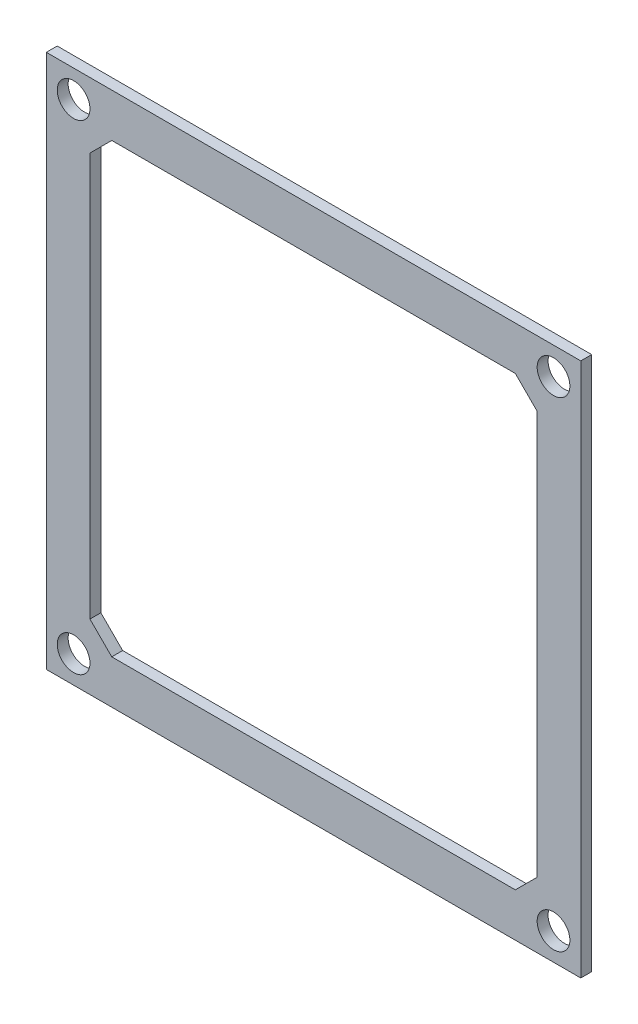
ISO-10303-21;
HEADER;
FILE_DESCRIPTION(('STEP AP214'),'2;1');
FILE_NAME('part.step','',(''),(''),'','','');
FILE_SCHEMA(('AUTOMOTIVE_DESIGN { 1 0 10303 214 1 1 1 1 }'));
ENDSEC;
DATA;
#1=APPLICATION_CONTEXT('core data for automotive mechanical design processes');
#2=APPLICATION_PROTOCOL_DEFINITION('international standard','automotive_design',2000,#1);
#3=PRODUCT_CONTEXT('',#1,'mechanical');
#4=PRODUCT('Part','Part','',(#3));
#5=PRODUCT_RELATED_PRODUCT_CATEGORY('part','',(#4));
#6=PRODUCT_DEFINITION_FORMATION('','',#4);
#7=PRODUCT_DEFINITION_CONTEXT('part definition',#1,'design');
#8=PRODUCT_DEFINITION('design','',#6,#7);
#9=PRODUCT_DEFINITION_SHAPE('','',#8);
#10=(LENGTH_UNIT() NAMED_UNIT(*) SI_UNIT(.MILLI.,.METRE.));
#11=(NAMED_UNIT(*) PLANE_ANGLE_UNIT() SI_UNIT($,.RADIAN.));
#12=(NAMED_UNIT(*) SI_UNIT($,.STERADIAN.) SOLID_ANGLE_UNIT());
#13=UNCERTAINTY_MEASURE_WITH_UNIT(LENGTH_MEASURE(1.E-05),#10,'distance_accuracy_value','');
#14=(GEOMETRIC_REPRESENTATION_CONTEXT(3) GLOBAL_UNCERTAINTY_ASSIGNED_CONTEXT((#13)) GLOBAL_UNIT_ASSIGNED_CONTEXT((#10,
#11,#12)) REPRESENTATION_CONTEXT('',''));
#15=CARTESIAN_POINT('',(0.,0.,0.));
#16=DIRECTION('',(0.,0.,1.));
#17=DIRECTION('',(1.,0.,0.));
#18=AXIS2_PLACEMENT_3D('',#15,#16,#17);
#19=CARTESIAN_POINT('',(0.,0.,1.));
#20=DIRECTION('',(0.,0.,1.));
#21=DIRECTION('',(1.,0.,0.));
#22=AXIS2_PLACEMENT_3D('',#19,#20,#21);
#23=PLANE('',#22);
#24=CARTESIAN_POINT('',(-18.5765575330891,-16.8021283227848,1.));
#25=DIRECTION('',(0.,0.,1.));
#26=DIRECTION('',(1.,0.,0.));
#27=AXIS2_PLACEMENT_3D('',#24,#25,#26);
#28=CIRCLE('',#27,1.5);
#29=CARTESIAN_POINT('',(-17.0765575330891,-16.8021283227848,1.));
#30=VERTEX_POINT('',#29);
#31=EDGE_CURVE('E313',#30,#30,#28,.T.);
#32=ORIENTED_EDGE('',*,*,#31,.F.);
#33=EDGE_LOOP('',(#32));
#34=FACE_BOUND('',#33,.T.);
#35=CARTESIAN_POINT('',(-62.5765575330896,27.1978716772152,1.));
#36=DIRECTION('',(0.,0.,1.));
#37=DIRECTION('',(1.,0.,0.));
#38=AXIS2_PLACEMENT_3D('',#35,#36,#37);
#39=CIRCLE('',#38,1.5);
#40=CARTESIAN_POINT('',(-61.0765575330896,27.1978716772152,1.));
#41=VERTEX_POINT('',#40);
#42=EDGE_CURVE('E159',#41,#41,#39,.T.);
#43=ORIENTED_EDGE('',*,*,#42,.F.);
#44=EDGE_LOOP('',(#43));
#45=FACE_BOUND('',#44,.T.);
#46=DIRECTION('',(0.,-1.,0.));
#47=VECTOR('',#46,1.);
#48=CARTESIAN_POINT('',(-65.0765575330896,29.6978716772152,1.));
#49=LINE('',#48,#47);
#50=CARTESIAN_POINT('',(-65.0765575330896,29.6978716772152,1.));
#51=VERTEX_POINT('',#50);
#52=CARTESIAN_POINT('',(-65.0765575330896,-19.3021283227848,1.));
#53=VERTEX_POINT('',#52);
#54=EDGE_CURVE('E189',#51,#53,#49,.T.);
#55=ORIENTED_EDGE('',*,*,#54,.T.);
#56=DIRECTION('',(1.,0.,0.));
#57=VECTOR('',#56,1.);
#58=CARTESIAN_POINT('',(-65.0765575330896,-19.3021283227848,1.));
#59=LINE('',#58,#57);
#60=CARTESIAN_POINT('',(-16.0765575330896,-19.3021283227848,1.));
#61=VERTEX_POINT('',#60);
#62=EDGE_CURVE('E192',#53,#61,#59,.T.);
#63=ORIENTED_EDGE('',*,*,#62,.T.);
#64=DIRECTION('',(0.,1.,0.));
#65=VECTOR('',#64,1.);
#66=CARTESIAN_POINT('',(-16.0765575330896,29.6978716772152,1.));
#67=LINE('',#66,#65);
#68=CARTESIAN_POINT('',(-16.0765575330896,29.6978716772152,1.));
#69=VERTEX_POINT('',#68);
#70=EDGE_CURVE('E195',#61,#69,#67,.T.);
#71=ORIENTED_EDGE('',*,*,#70,.T.);
#72=DIRECTION('',(-1.,0.,0.));
#73=VECTOR('',#72,1.);
#74=CARTESIAN_POINT('',(-65.0765575330896,29.6978716772152,1.));
#75=LINE('',#74,#73);
#76=EDGE_CURVE('E197',#69,#51,#75,.T.);
#77=ORIENTED_EDGE('',*,*,#76,.T.);
#78=EDGE_LOOP('',(#55,#63,#71,#77));
#79=FACE_BOUND('',#78,.T.);
#80=DIRECTION('',(0.,-1.,0.));
#81=VECTOR('',#80,1.);
#82=CARTESIAN_POINT('',(-61.0765575330896,23.6978716772152,1.));
#83=LINE('',#82,#81);
#84=CARTESIAN_POINT('',(-61.0765575330896,23.6978716772152,1.));
#85=VERTEX_POINT('',#84);
#86=CARTESIAN_POINT('',(-61.0765575330896,-13.3021283227848,1.));
#87=VERTEX_POINT('',#86);
#88=EDGE_CURVE('E129',#85,#87,#83,.T.);
#89=ORIENTED_EDGE('',*,*,#88,.F.);
#90=DIRECTION('',(-0.707106781186552,-0.707106781186543,0.));
#91=VECTOR('',#90,1.);
#92=CARTESIAN_POINT('',(-59.0765575330896,25.6978716772152,1.));
#93=LINE('',#92,#91);
#94=CARTESIAN_POINT('',(-59.0765575330896,25.6978716772152,1.));
#95=VERTEX_POINT('',#94);
#96=EDGE_CURVE('E121',#95,#85,#93,.T.);
#97=ORIENTED_EDGE('',*,*,#96,.F.);
#98=DIRECTION('',(-1.,0.,0.));
#99=VECTOR('',#98,1.);
#100=CARTESIAN_POINT('',(-22.0765575330896,25.6978716772152,1.));
#101=LINE('',#100,#99);
#102=CARTESIAN_POINT('',(-22.0765575330896,25.6978716772152,1.));
#103=VERTEX_POINT('',#102);
#104=EDGE_CURVE('E156',#103,#95,#101,.T.);
#105=ORIENTED_EDGE('',*,*,#104,.F.);
#106=DIRECTION('',(-0.707106781186559,0.707106781186536,0.));
#107=VECTOR('',#106,1.);
#108=CARTESIAN_POINT('',(-20.0765575330895,23.6978716772152,1.));
#109=LINE('',#108,#107);
#110=CARTESIAN_POINT('',(-20.0765575330895,23.6978716772152,1.));
#111=VERTEX_POINT('',#110);
#112=EDGE_CURVE('E154',#111,#103,#109,.T.);
#113=ORIENTED_EDGE('',*,*,#112,.F.);
#114=DIRECTION('',(0.,1.,0.));
#115=VECTOR('',#114,1.);
#116=CARTESIAN_POINT('',(-20.0765575330896,-13.3021283227848,1.));
#117=LINE('',#116,#115);
#118=CARTESIAN_POINT('',(-20.0765575330896,-13.3021283227848,1.));
#119=VERTEX_POINT('',#118);
#120=EDGE_CURVE('E152',#119,#111,#117,.T.);
#121=ORIENTED_EDGE('',*,*,#120,.F.);
#122=DIRECTION('',(0.707106781186536,0.707106781186559,0.));
#123=VECTOR('',#122,1.);
#124=CARTESIAN_POINT('',(-22.0765575330895,-15.3021283227848,1.));
#125=LINE('',#124,#123);
#126=CARTESIAN_POINT('',(-22.0765575330895,-15.3021283227848,1.));
#127=VERTEX_POINT('',#126);
#128=EDGE_CURVE('E150',#127,#119,#125,.T.);
#129=ORIENTED_EDGE('',*,*,#128,.F.);
#130=DIRECTION('',(1.,0.,0.));
#131=VECTOR('',#130,1.);
#132=CARTESIAN_POINT('',(-59.0765575330895,-15.3021283227848,1.));
#133=LINE('',#132,#131);
#134=CARTESIAN_POINT('',(-59.0765575330895,-15.3021283227848,1.));
#135=VERTEX_POINT('',#134);
#136=EDGE_CURVE('E145',#135,#127,#133,.T.);
#137=ORIENTED_EDGE('',*,*,#136,.F.);
#138=DIRECTION('',(0.707106781186559,-0.707106781186536,0.));
#139=VECTOR('',#138,1.);
#140=CARTESIAN_POINT('',(-61.0765575330896,-13.3021283227848,1.));
#141=LINE('',#140,#139);
#142=EDGE_CURVE('E143',#87,#135,#141,.T.);
#143=ORIENTED_EDGE('',*,*,#142,.F.);
#144=EDGE_LOOP('',(#89,#97,#105,#113,#121,#129,#137,#143));
#145=FACE_BOUND('',#144,.T.);
#146=CARTESIAN_POINT('',(-18.5765575330896,27.1978716772152,1.));
#147=DIRECTION('',(0.,0.,1.));
#148=DIRECTION('',(1.,0.,0.));
#149=AXIS2_PLACEMENT_3D('',#146,#147,#148);
#150=CIRCLE('',#149,1.5);
#151=CARTESIAN_POINT('',(-17.0765575330896,27.1978716772152,1.));
#152=VERTEX_POINT('',#151);
#153=EDGE_CURVE('E319',#152,#152,#150,.T.);
#154=ORIENTED_EDGE('',*,*,#153,.F.);
#155=EDGE_LOOP('',(#154));
#156=FACE_BOUND('',#155,.T.);
#157=CARTESIAN_POINT('',(-62.5765575330891,-16.8021283227848,1.));
#158=DIRECTION('',(0.,0.,1.));
#159=DIRECTION('',(1.,0.,0.));
#160=AXIS2_PLACEMENT_3D('',#157,#158,#159);
#161=CIRCLE('',#160,1.5);
#162=CARTESIAN_POINT('',(-61.0765575330891,-16.8021283227848,1.));
#163=VERTEX_POINT('',#162);
#164=EDGE_CURVE('E304',#163,#163,#161,.T.);
#165=ORIENTED_EDGE('',*,*,#164,.F.);
#166=EDGE_LOOP('',(#165));
#167=FACE_BOUND('',#166,.T.);
#168=ADVANCED_FACE('F32',(#34,#45,#79,#145,#156,#167),#23,.T.);
#169=CARTESIAN_POINT('',(0.,0.,0.));
#170=DIRECTION('',(0.,0.,1.));
#171=DIRECTION('',(1.,0.,0.));
#172=AXIS2_PLACEMENT_3D('',#169,#170,#171);
#173=PLANE('',#172);
#174=DIRECTION('',(0.,-1.,0.));
#175=VECTOR('',#174,1.);
#176=CARTESIAN_POINT('',(-65.0765575330896,29.6978716772152,0.));
#177=LINE('',#176,#175);
#178=CARTESIAN_POINT('',(-65.0765575330896,29.6978716772152,0.));
#179=VERTEX_POINT('',#178);
#180=CARTESIAN_POINT('',(-65.0765575330896,-19.3021283227848,0.));
#181=VERTEX_POINT('',#180);
#182=EDGE_CURVE('E137',#179,#181,#177,.T.);
#183=ORIENTED_EDGE('',*,*,#182,.F.);
#184=DIRECTION('',(-1.,0.,0.));
#185=VECTOR('',#184,1.);
#186=CARTESIAN_POINT('',(-65.0765575330896,29.6978716772152,0.));
#187=LINE('',#186,#185);
#188=CARTESIAN_POINT('',(-16.0765575330896,29.6978716772152,0.));
#189=VERTEX_POINT('',#188);
#190=EDGE_CURVE('E193',#189,#179,#187,.T.);
#191=ORIENTED_EDGE('',*,*,#190,.F.);
#192=DIRECTION('',(0.,1.,0.));
#193=VECTOR('',#192,1.);
#194=CARTESIAN_POINT('',(-16.0765575330896,29.6978716772152,0.));
#195=LINE('',#194,#193);
#196=CARTESIAN_POINT('',(-16.0765575330896,-19.3021283227848,0.));
#197=VERTEX_POINT('',#196);
#198=EDGE_CURVE('E204',#197,#189,#195,.T.);
#199=ORIENTED_EDGE('',*,*,#198,.F.);
#200=DIRECTION('',(1.,0.,0.));
#201=VECTOR('',#200,1.);
#202=CARTESIAN_POINT('',(-65.0765575330896,-19.3021283227848,0.));
#203=LINE('',#202,#201);
#204=EDGE_CURVE('E202',#181,#197,#203,.T.);
#205=ORIENTED_EDGE('',*,*,#204,.F.);
#206=EDGE_LOOP('',(#183,#191,#199,#205));
#207=FACE_BOUND('',#206,.T.);
#208=DIRECTION('',(-0.707106781186552,-0.707106781186543,0.));
#209=VECTOR('',#208,1.);
#210=CARTESIAN_POINT('',(-59.0765575330896,25.6978716772152,0.));
#211=LINE('',#210,#209);
#212=CARTESIAN_POINT('',(-59.0765575330896,25.6978716772152,0.));
#213=VERTEX_POINT('',#212);
#214=CARTESIAN_POINT('',(-61.0765575330896,23.6978716772152,0.));
#215=VERTEX_POINT('',#214);
#216=EDGE_CURVE('E55',#213,#215,#211,.T.);
#217=ORIENTED_EDGE('',*,*,#216,.T.);
#218=DIRECTION('',(0.,-1.,0.));
#219=VECTOR('',#218,1.);
#220=CARTESIAN_POINT('',(-61.0765575330896,23.6978716772152,0.));
#221=LINE('',#220,#219);
#222=CARTESIAN_POINT('',(-61.0765575330896,-13.3021283227848,0.));
#223=VERTEX_POINT('',#222);
#224=EDGE_CURVE('E136',#215,#223,#221,.T.);
#225=ORIENTED_EDGE('',*,*,#224,.T.);
#226=DIRECTION('',(0.707106781186559,-0.707106781186536,0.));
#227=VECTOR('',#226,1.);
#228=CARTESIAN_POINT('',(-61.0765575330896,-13.3021283227848,0.));
#229=LINE('',#228,#227);
#230=CARTESIAN_POINT('',(-59.0765575330895,-15.3021283227848,0.));
#231=VERTEX_POINT('',#230);
#232=EDGE_CURVE('E161',#223,#231,#229,.T.);
#233=ORIENTED_EDGE('',*,*,#232,.T.);
#234=DIRECTION('',(1.,0.,0.));
#235=VECTOR('',#234,1.);
#236=CARTESIAN_POINT('',(-59.0765575330895,-15.3021283227848,0.));
#237=LINE('',#236,#235);
#238=CARTESIAN_POINT('',(-22.0765575330895,-15.3021283227848,0.));
#239=VERTEX_POINT('',#238);
#240=EDGE_CURVE('E164',#231,#239,#237,.T.);
#241=ORIENTED_EDGE('',*,*,#240,.T.);
#242=DIRECTION('',(0.707106781186536,0.707106781186559,0.));
#243=VECTOR('',#242,1.);
#244=CARTESIAN_POINT('',(-22.0765575330895,-15.3021283227848,0.));
#245=LINE('',#244,#243);
#246=CARTESIAN_POINT('',(-20.0765575330896,-13.3021283227848,0.));
#247=VERTEX_POINT('',#246);
#248=EDGE_CURVE('E167',#239,#247,#245,.T.);
#249=ORIENTED_EDGE('',*,*,#248,.T.);
#250=DIRECTION('',(0.,1.,0.));
#251=VECTOR('',#250,1.);
#252=CARTESIAN_POINT('',(-20.0765575330896,-13.3021283227848,0.));
#253=LINE('',#252,#251);
#254=CARTESIAN_POINT('',(-20.0765575330895,23.6978716772152,0.));
#255=VERTEX_POINT('',#254);
#256=EDGE_CURVE('E170',#247,#255,#253,.T.);
#257=ORIENTED_EDGE('',*,*,#256,.T.);
#258=DIRECTION('',(-0.707106781186559,0.707106781186536,0.));
#259=VECTOR('',#258,1.);
#260=CARTESIAN_POINT('',(-20.0765575330895,23.6978716772152,0.));
#261=LINE('',#260,#259);
#262=CARTESIAN_POINT('',(-22.0765575330896,25.6978716772152,0.));
#263=VERTEX_POINT('',#262);
#264=EDGE_CURVE('E173',#255,#263,#261,.T.);
#265=ORIENTED_EDGE('',*,*,#264,.T.);
#266=DIRECTION('',(-1.,0.,0.));
#267=VECTOR('',#266,1.);
#268=CARTESIAN_POINT('',(-22.0765575330896,25.6978716772152,0.));
#269=LINE('',#268,#267);
#270=EDGE_CURVE('E130',#263,#213,#269,.T.);
#271=ORIENTED_EDGE('',*,*,#270,.T.);
#272=EDGE_LOOP('',(#217,#225,#233,#241,#249,#257,#265,#271));
#273=FACE_BOUND('',#272,.T.);
#274=CARTESIAN_POINT('',(-62.5765575330896,27.1978716772152,0.));
#275=DIRECTION('',(0.,0.,1.));
#276=DIRECTION('',(1.,0.,0.));
#277=AXIS2_PLACEMENT_3D('',#274,#275,#276);
#278=CIRCLE('',#277,1.5);
#279=CARTESIAN_POINT('',(-61.0765575330896,27.1978716772152,0.));
#280=VERTEX_POINT('',#279);
#281=EDGE_CURVE('E322',#280,#280,#278,.T.);
#282=ORIENTED_EDGE('',*,*,#281,.T.);
#283=EDGE_LOOP('',(#282));
#284=FACE_BOUND('',#283,.T.);
#285=CARTESIAN_POINT('',(-18.5765575330896,27.1978716772152,0.));
#286=DIRECTION('',(0.,0.,1.));
#287=DIRECTION('',(1.,0.,0.));
#288=AXIS2_PLACEMENT_3D('',#285,#286,#287);
#289=CIRCLE('',#288,1.5);
#290=CARTESIAN_POINT('',(-17.0765575330896,27.1978716772152,0.));
#291=VERTEX_POINT('',#290);
#292=EDGE_CURVE('E316',#291,#291,#289,.T.);
#293=ORIENTED_EDGE('',*,*,#292,.T.);
#294=EDGE_LOOP('',(#293));
#295=FACE_BOUND('',#294,.T.);
#296=CARTESIAN_POINT('',(-18.5765575330891,-16.8021283227848,0.));
#297=DIRECTION('',(0.,0.,1.));
#298=DIRECTION('',(1.,0.,0.));
#299=AXIS2_PLACEMENT_3D('',#296,#297,#298);
#300=CIRCLE('',#299,1.5);
#301=CARTESIAN_POINT('',(-17.0765575330891,-16.8021283227848,0.));
#302=VERTEX_POINT('',#301);
#303=EDGE_CURVE('E310',#302,#302,#300,.T.);
#304=ORIENTED_EDGE('',*,*,#303,.T.);
#305=EDGE_LOOP('',(#304));
#306=FACE_BOUND('',#305,.T.);
#307=CARTESIAN_POINT('',(-62.5765575330891,-16.8021283227848,0.));
#308=DIRECTION('',(0.,0.,1.));
#309=DIRECTION('',(1.,0.,0.));
#310=AXIS2_PLACEMENT_3D('',#307,#308,#309);
#311=CIRCLE('',#310,1.5);
#312=CARTESIAN_POINT('',(-61.0765575330891,-16.8021283227848,0.));
#313=VERTEX_POINT('',#312);
#314=EDGE_CURVE('E307',#313,#313,#311,.T.);
#315=ORIENTED_EDGE('',*,*,#314,.T.);
#316=EDGE_LOOP('',(#315));
#317=FACE_BOUND('',#316,.T.);
#318=ADVANCED_FACE('F222',(#207,#273,#284,#295,#306,#317),#173,.F.);
#319=CARTESIAN_POINT('',(-65.0765575330896,29.6978716772152,1.));
#320=DIRECTION('',(1.,0.,0.));
#321=DIRECTION('',(0.,1.,0.));
#322=AXIS2_PLACEMENT_3D('',#319,#320,#321);
#323=PLANE('',#322);
#324=ORIENTED_EDGE('',*,*,#182,.T.);
#325=DIRECTION('',(0.,0.,-1.));
#326=VECTOR('',#325,1.);
#327=CARTESIAN_POINT('',(-65.0765575330896,-19.3021283227848,1.));
#328=LINE('',#327,#326);
#329=EDGE_CURVE('E11',#53,#181,#328,.T.);
#330=ORIENTED_EDGE('',*,*,#329,.F.);
#331=ORIENTED_EDGE('',*,*,#54,.F.);
#332=DIRECTION('',(0.,0.,-1.));
#333=VECTOR('',#332,1.);
#334=CARTESIAN_POINT('',(-65.0765575330896,29.6978716772152,1.));
#335=LINE('',#334,#333);
#336=EDGE_CURVE('E199',#51,#179,#335,.T.);
#337=ORIENTED_EDGE('',*,*,#336,.T.);
#338=EDGE_LOOP('',(#324,#330,#331,#337));
#339=FACE_BOUND('',#338,.T.);
#340=ADVANCED_FACE('F34',(#339),#323,.F.);
#341=CARTESIAN_POINT('',(-65.0765575330896,-19.3021283227848,1.));
#342=DIRECTION('',(0.,1.,0.));
#343=DIRECTION('',(-1.,0.,0.));
#344=AXIS2_PLACEMENT_3D('',#341,#342,#343);
#345=PLANE('',#344);
#346=ORIENTED_EDGE('',*,*,#204,.T.);
#347=DIRECTION('',(0.,0.,-1.));
#348=VECTOR('',#347,1.);
#349=CARTESIAN_POINT('',(-16.0765575330896,-19.3021283227848,1.));
#350=LINE('',#349,#348);
#351=EDGE_CURVE('E40',#61,#197,#350,.T.);
#352=ORIENTED_EDGE('',*,*,#351,.F.);
#353=ORIENTED_EDGE('',*,*,#62,.F.);
#354=ORIENTED_EDGE('',*,*,#329,.T.);
#355=EDGE_LOOP('',(#346,#352,#353,#354));
#356=FACE_BOUND('',#355,.T.);
#357=ADVANCED_FACE('F232',(#356),#345,.F.);
#358=CARTESIAN_POINT('',(-16.0765575330896,29.6978716772152,1.));
#359=DIRECTION('',(-1.,0.,0.));
#360=DIRECTION('',(0.,-1.,0.));
#361=AXIS2_PLACEMENT_3D('',#358,#359,#360);
#362=PLANE('',#361);
#363=ORIENTED_EDGE('',*,*,#198,.T.);
#364=DIRECTION('',(0.,0.,-1.));
#365=VECTOR('',#364,1.);
#366=CARTESIAN_POINT('',(-16.0765575330896,29.6978716772152,1.));
#367=LINE('',#366,#365);
#368=EDGE_CURVE('E209',#69,#189,#367,.T.);
#369=ORIENTED_EDGE('',*,*,#368,.F.);
#370=ORIENTED_EDGE('',*,*,#70,.F.);
#371=ORIENTED_EDGE('',*,*,#351,.T.);
#372=EDGE_LOOP('',(#363,#369,#370,#371));
#373=FACE_BOUND('',#372,.T.);
#374=ADVANCED_FACE('F216',(#373),#362,.F.);
#375=CARTESIAN_POINT('',(-65.0765575330896,29.6978716772152,1.));
#376=DIRECTION('',(0.,-1.,0.));
#377=DIRECTION('',(0.,0.,-1.));
#378=AXIS2_PLACEMENT_3D('',#375,#376,#377);
#379=PLANE('',#378);
#380=ORIENTED_EDGE('',*,*,#190,.T.);
#381=ORIENTED_EDGE('',*,*,#336,.F.);
#382=ORIENTED_EDGE('',*,*,#76,.F.);
#383=ORIENTED_EDGE('',*,*,#368,.T.);
#384=EDGE_LOOP('',(#380,#381,#382,#383));
#385=FACE_BOUND('',#384,.T.);
#386=ADVANCED_FACE('F226',(#385),#379,.F.);
#387=CARTESIAN_POINT('',(-59.0765575330896,25.6978716772152,1.));
#388=DIRECTION('',(0.707106781186543,-0.707106781186552,0.));
#389=DIRECTION('',(0.707106781186552,0.707106781186543,0.));
#390=AXIS2_PLACEMENT_3D('',#387,#388,#389);
#391=PLANE('',#390);
#392=ORIENTED_EDGE('',*,*,#216,.F.);
#393=DIRECTION('',(0.,0.,-1.));
#394=VECTOR('',#393,1.);
#395=CARTESIAN_POINT('',(-59.0765575330896,25.6978716772152,1.));
#396=LINE('',#395,#394);
#397=EDGE_CURVE('E125',#95,#213,#396,.T.);
#398=ORIENTED_EDGE('',*,*,#397,.F.);
#399=ORIENTED_EDGE('',*,*,#96,.T.);
#400=DIRECTION('',(0.,0.,-1.));
#401=VECTOR('',#400,1.);
#402=CARTESIAN_POINT('',(-61.0765575330896,23.6978716772152,1.));
#403=LINE('',#402,#401);
#404=EDGE_CURVE('E124',#85,#215,#403,.T.);
#405=ORIENTED_EDGE('',*,*,#404,.T.);
#406=EDGE_LOOP('',(#392,#398,#399,#405));
#407=FACE_BOUND('',#406,.T.);
#408=ADVANCED_FACE('F123',(#407),#391,.T.);
#409=CARTESIAN_POINT('',(-61.0765575330896,23.6978716772152,1.));
#410=DIRECTION('',(1.,0.,0.));
#411=DIRECTION('',(0.,0.,-1.));
#412=AXIS2_PLACEMENT_3D('',#409,#410,#411);
#413=PLANE('',#412);
#414=ORIENTED_EDGE('',*,*,#224,.F.);
#415=ORIENTED_EDGE('',*,*,#404,.F.);
#416=ORIENTED_EDGE('',*,*,#88,.T.);
#417=DIRECTION('',(0.,0.,-1.));
#418=VECTOR('',#417,1.);
#419=CARTESIAN_POINT('',(-61.0765575330896,-13.3021283227848,1.));
#420=LINE('',#419,#418);
#421=EDGE_CURVE('E138',#87,#223,#420,.T.);
#422=ORIENTED_EDGE('',*,*,#421,.T.);
#423=EDGE_LOOP('',(#414,#415,#416,#422));
#424=FACE_BOUND('',#423,.T.);
#425=ADVANCED_FACE('F133',(#424),#413,.T.);
#426=CARTESIAN_POINT('',(-61.0765575330896,-13.3021283227848,1.));
#427=DIRECTION('',(0.707106781186536,0.707106781186559,0.));
#428=DIRECTION('',(-0.707106781186559,0.707106781186536,0.));
#429=AXIS2_PLACEMENT_3D('',#426,#427,#428);
#430=PLANE('',#429);
#431=ORIENTED_EDGE('',*,*,#232,.F.);
#432=ORIENTED_EDGE('',*,*,#421,.F.);
#433=ORIENTED_EDGE('',*,*,#142,.T.);
#434=DIRECTION('',(0.,0.,-1.));
#435=VECTOR('',#434,1.);
#436=CARTESIAN_POINT('',(-59.0765575330895,-15.3021283227848,1.));
#437=LINE('',#436,#435);
#438=EDGE_CURVE('E186',#135,#231,#437,.T.);
#439=ORIENTED_EDGE('',*,*,#438,.T.);
#440=EDGE_LOOP('',(#431,#432,#433,#439));
#441=FACE_BOUND('',#440,.T.);
#442=ADVANCED_FACE('F258',(#441),#430,.T.);
#443=CARTESIAN_POINT('',(-59.0765575330895,-15.3021283227848,1.));
#444=DIRECTION('',(0.,1.,0.));
#445=DIRECTION('',(0.,0.,1.));
#446=AXIS2_PLACEMENT_3D('',#443,#444,#445);
#447=PLANE('',#446);
#448=ORIENTED_EDGE('',*,*,#240,.F.);
#449=ORIENTED_EDGE('',*,*,#438,.F.);
#450=ORIENTED_EDGE('',*,*,#136,.T.);
#451=DIRECTION('',(0.,0.,-1.));
#452=VECTOR('',#451,1.);
#453=CARTESIAN_POINT('',(-22.0765575330895,-15.3021283227848,1.));
#454=LINE('',#453,#452);
#455=EDGE_CURVE('E184',#127,#239,#454,.T.);
#456=ORIENTED_EDGE('',*,*,#455,.T.);
#457=EDGE_LOOP('',(#448,#449,#450,#456));
#458=FACE_BOUND('',#457,.T.);
#459=ADVANCED_FACE('F262',(#458),#447,.T.);
#460=CARTESIAN_POINT('',(-22.0765575330895,-15.3021283227848,1.));
#461=DIRECTION('',(-0.707106781186559,0.707106781186536,0.));
#462=DIRECTION('',(-0.707106781186536,-0.707106781186559,0.));
#463=AXIS2_PLACEMENT_3D('',#460,#461,#462);
#464=PLANE('',#463);
#465=ORIENTED_EDGE('',*,*,#248,.F.);
#466=ORIENTED_EDGE('',*,*,#455,.F.);
#467=ORIENTED_EDGE('',*,*,#128,.T.);
#468=DIRECTION('',(0.,0.,-1.));
#469=VECTOR('',#468,1.);
#470=CARTESIAN_POINT('',(-20.0765575330896,-13.3021283227848,1.));
#471=LINE('',#470,#469);
#472=EDGE_CURVE('E182',#119,#247,#471,.T.);
#473=ORIENTED_EDGE('',*,*,#472,.T.);
#474=EDGE_LOOP('',(#465,#466,#467,#473));
#475=FACE_BOUND('',#474,.T.);
#476=ADVANCED_FACE('F268',(#475),#464,.T.);
#477=CARTESIAN_POINT('',(-20.0765575330896,-13.3021283227848,1.));
#478=DIRECTION('',(-1.,0.,0.));
#479=DIRECTION('',(0.,-1.,0.));
#480=AXIS2_PLACEMENT_3D('',#477,#478,#479);
#481=PLANE('',#480);
#482=ORIENTED_EDGE('',*,*,#256,.F.);
#483=ORIENTED_EDGE('',*,*,#472,.F.);
#484=ORIENTED_EDGE('',*,*,#120,.T.);
#485=DIRECTION('',(0.,0.,-1.));
#486=VECTOR('',#485,1.);
#487=CARTESIAN_POINT('',(-20.0765575330895,23.6978716772152,1.));
#488=LINE('',#487,#486);
#489=EDGE_CURVE('E180',#111,#255,#488,.T.);
#490=ORIENTED_EDGE('',*,*,#489,.T.);
#491=EDGE_LOOP('',(#482,#483,#484,#490));
#492=FACE_BOUND('',#491,.T.);
#493=ADVANCED_FACE('F272',(#492),#481,.T.);
#494=CARTESIAN_POINT('',(-20.0765575330895,23.6978716772152,1.));
#495=DIRECTION('',(-0.707106781186536,-0.707106781186559,0.));
#496=DIRECTION('',(0.707106781186559,-0.707106781186536,0.));
#497=AXIS2_PLACEMENT_3D('',#494,#495,#496);
#498=PLANE('',#497);
#499=ORIENTED_EDGE('',*,*,#264,.F.);
#500=ORIENTED_EDGE('',*,*,#489,.F.);
#501=ORIENTED_EDGE('',*,*,#112,.T.);
#502=DIRECTION('',(0.,0.,-1.));
#503=VECTOR('',#502,1.);
#504=CARTESIAN_POINT('',(-22.0765575330896,25.6978716772152,1.));
#505=LINE('',#504,#503);
#506=EDGE_CURVE('E47',#103,#263,#505,.T.);
#507=ORIENTED_EDGE('',*,*,#506,.T.);
#508=EDGE_LOOP('',(#499,#500,#501,#507));
#509=FACE_BOUND('',#508,.T.);
#510=ADVANCED_FACE('F276',(#509),#498,.T.);
#511=CARTESIAN_POINT('',(-22.0765575330896,25.6978716772152,1.));
#512=DIRECTION('',(0.,-1.,0.));
#513=DIRECTION('',(1.,0.,0.));
#514=AXIS2_PLACEMENT_3D('',#511,#512,#513);
#515=PLANE('',#514);
#516=ORIENTED_EDGE('',*,*,#270,.F.);
#517=ORIENTED_EDGE('',*,*,#506,.F.);
#518=ORIENTED_EDGE('',*,*,#104,.T.);
#519=ORIENTED_EDGE('',*,*,#397,.T.);
#520=EDGE_LOOP('',(#516,#517,#518,#519));
#521=FACE_BOUND('',#520,.T.);
#522=ADVANCED_FACE('F280',(#521),#515,.T.);
#523=CARTESIAN_POINT('',(-62.5765575330896,27.1978716772152,1.));
#524=DIRECTION('',(0.,0.,-1.));
#525=DIRECTION('',(-1.,0.,0.));
#526=AXIS2_PLACEMENT_3D('',#523,#524,#525);
#527=CYLINDRICAL_SURFACE('',#526,1.5);
#528=ORIENTED_EDGE('',*,*,#42,.T.);
#529=EDGE_LOOP('',(#528));
#530=FACE_BOUND('',#529,.T.);
#531=ORIENTED_EDGE('',*,*,#281,.F.);
#532=EDGE_LOOP('',(#531));
#533=FACE_BOUND('',#532,.T.);
#534=ADVANCED_FACE('F284',(#530,#533),#527,.F.);
#535=CARTESIAN_POINT('',(-18.5765575330896,27.1978716772152,1.));
#536=DIRECTION('',(0.,0.,-1.));
#537=DIRECTION('',(-1.,0.,0.));
#538=AXIS2_PLACEMENT_3D('',#535,#536,#537);
#539=CYLINDRICAL_SURFACE('',#538,1.5);
#540=ORIENTED_EDGE('',*,*,#153,.T.);
#541=EDGE_LOOP('',(#540));
#542=FACE_BOUND('',#541,.T.);
#543=ORIENTED_EDGE('',*,*,#292,.F.);
#544=EDGE_LOOP('',(#543));
#545=FACE_BOUND('',#544,.T.);
#546=ADVANCED_FACE('F287',(#542,#545),#539,.F.);
#547=CARTESIAN_POINT('',(-18.5765575330891,-16.8021283227848,1.));
#548=DIRECTION('',(0.,0.,-1.));
#549=DIRECTION('',(-1.,0.,0.));
#550=AXIS2_PLACEMENT_3D('',#547,#548,#549);
#551=CYLINDRICAL_SURFACE('',#550,1.5);
#552=ORIENTED_EDGE('',*,*,#31,.T.);
#553=EDGE_LOOP('',(#552));
#554=FACE_BOUND('',#553,.T.);
#555=ORIENTED_EDGE('',*,*,#303,.F.);
#556=EDGE_LOOP('',(#555));
#557=FACE_BOUND('',#556,.T.);
#558=ADVANCED_FACE('F291',(#554,#557),#551,.F.);
#559=CARTESIAN_POINT('',(-62.5765575330891,-16.8021283227848,1.));
#560=DIRECTION('',(0.,0.,-1.));
#561=DIRECTION('',(-1.,0.,0.));
#562=AXIS2_PLACEMENT_3D('',#559,#560,#561);
#563=CYLINDRICAL_SURFACE('',#562,1.5);
#564=ORIENTED_EDGE('',*,*,#164,.T.);
#565=EDGE_LOOP('',(#564));
#566=FACE_BOUND('',#565,.T.);
#567=ORIENTED_EDGE('',*,*,#314,.F.);
#568=EDGE_LOOP('',(#567));
#569=FACE_BOUND('',#568,.T.);
#570=ADVANCED_FACE('F295',(#566,#569),#563,.F.);
#571=CLOSED_SHELL('',(#168,#318,#340,#357,#374,#386,#408,#425,#442,#459,#476,#493,#510,#522,
#534,#546,#558,#570));
#572=MANIFOLD_SOLID_BREP('B2',#571);
#573=ADVANCED_BREP_SHAPE_REPRESENTATION('',(#18,#572),#14);
#574=SHAPE_DEFINITION_REPRESENTATION(#9,#573);
ENDSEC;
END-ISO-10303-21;
